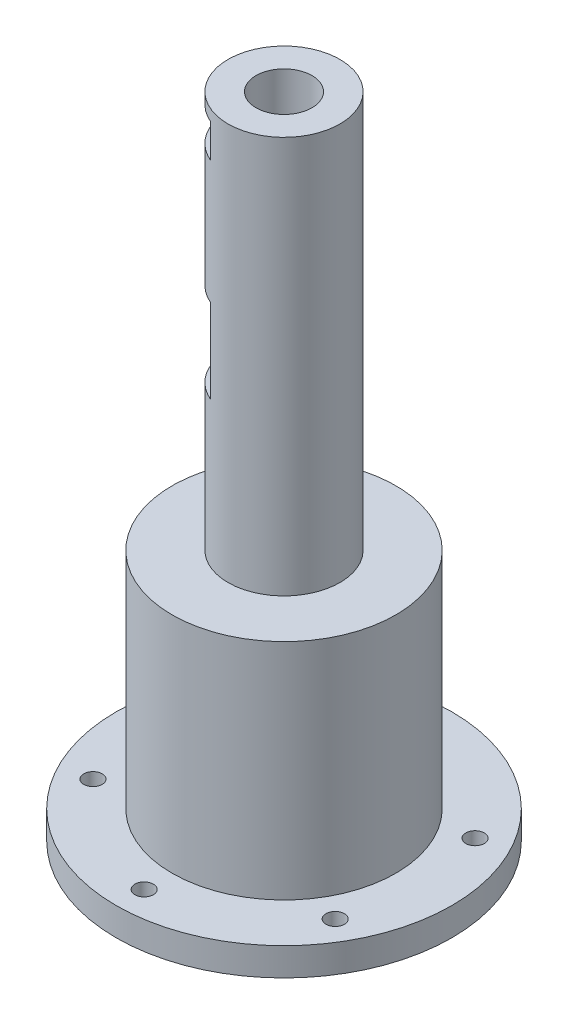
ISO-10303-21;
HEADER;
FILE_DESCRIPTION(('STEP AP214'),'2;1');
FILE_NAME('part.step','',(''),(''),'','','');
FILE_SCHEMA(('AUTOMOTIVE_DESIGN { 1 0 10303 214 1 1 1 1 }'));
ENDSEC;
DATA;
#1=APPLICATION_CONTEXT('core data for automotive mechanical design processes');
#2=APPLICATION_PROTOCOL_DEFINITION('international standard','automotive_design',2000,#1);
#3=PRODUCT_CONTEXT('',#1,'mechanical');
#4=PRODUCT('Part','Part','',(#3));
#5=PRODUCT_RELATED_PRODUCT_CATEGORY('part','',(#4));
#6=PRODUCT_DEFINITION_FORMATION('','',#4);
#7=PRODUCT_DEFINITION_CONTEXT('part definition',#1,'design');
#8=PRODUCT_DEFINITION('design','',#6,#7);
#9=PRODUCT_DEFINITION_SHAPE('','',#8);
#10=(LENGTH_UNIT() NAMED_UNIT(*) SI_UNIT(.MILLI.,.METRE.));
#11=(NAMED_UNIT(*) PLANE_ANGLE_UNIT() SI_UNIT($,.RADIAN.));
#12=(NAMED_UNIT(*) SI_UNIT($,.STERADIAN.) SOLID_ANGLE_UNIT());
#13=UNCERTAINTY_MEASURE_WITH_UNIT(LENGTH_MEASURE(1.E-05),#10,'distance_accuracy_value','');
#14=(GEOMETRIC_REPRESENTATION_CONTEXT(3) GLOBAL_UNCERTAINTY_ASSIGNED_CONTEXT((#13)) GLOBAL_UNIT_ASSIGNED_CONTEXT((#10,
#11,#12)) REPRESENTATION_CONTEXT('',''));
#15=CARTESIAN_POINT('',(0.,0.,0.));
#16=DIRECTION('',(0.,0.,1.));
#17=DIRECTION('',(1.,0.,0.));
#18=AXIS2_PLACEMENT_3D('',#15,#16,#17);
#19=CARTESIAN_POINT('',(0.,116.,0.));
#20=DIRECTION('',(0.,-1.,0.));
#21=DIRECTION('',(0.,0.,-1.));
#22=AXIS2_PLACEMENT_3D('',#19,#20,#21);
#23=CYLINDRICAL_SURFACE('',#22,10.);
#24=CARTESIAN_POINT('',(0.,108.,0.));
#25=DIRECTION('',(0.,-1.,0.));
#26=DIRECTION('',(0.,0.,-1.));
#27=AXIS2_PLACEMENT_3D('',#24,#25,#26);
#28=CIRCLE('',#27,10.);
#29=CARTESIAN_POINT('',(-6.,108.,-8.));
#30=VERTEX_POINT('',#29);
#31=CARTESIAN_POINT('',(6.,108.,-8.));
#32=VERTEX_POINT('',#31);
#33=EDGE_CURVE('E101',#30,#32,#28,.T.);
#34=ORIENTED_EDGE('',*,*,#33,.T.);
#35=DIRECTION('',(0.,-1.,0.));
#36=VECTOR('',#35,1.);
#37=CARTESIAN_POINT('',(6.,116.,-8.));
#38=LINE('',#37,#36);
#39=CARTESIAN_POINT('',(6.,114.,-8.));
#40=VERTEX_POINT('',#39);
#41=EDGE_CURVE('E11',#40,#32,#38,.T.);
#42=ORIENTED_EDGE('',*,*,#41,.F.);
#43=CARTESIAN_POINT('',(0.,114.,0.));
#44=DIRECTION('',(0.,1.,0.));
#45=DIRECTION('',(0.,0.,1.));
#46=AXIS2_PLACEMENT_3D('',#43,#44,#45);
#47=CIRCLE('',#46,10.);
#48=CARTESIAN_POINT('',(-6.,114.,-8.));
#49=VERTEX_POINT('',#48);
#50=EDGE_CURVE('E105',#40,#49,#47,.T.);
#51=ORIENTED_EDGE('',*,*,#50,.T.);
#52=DIRECTION('',(0.,-1.,0.));
#53=VECTOR('',#52,1.);
#54=CARTESIAN_POINT('',(-6.,116.,-8.));
#55=LINE('',#54,#53);
#56=EDGE_CURVE('E43',#30,#49,#55,.F.);
#57=ORIENTED_EDGE('',*,*,#56,.F.);
#58=EDGE_LOOP('',(#34,#42,#51,#57));
#59=FACE_BOUND('',#58,.T.);
#60=DIRECTION('',(0.,-1.,0.));
#61=VECTOR('',#60,1.);
#62=CARTESIAN_POINT('',(6.,116.,-8.));
#63=LINE('',#62,#61);
#64=CARTESIAN_POINT('',(6.,86.,-8.));
#65=VERTEX_POINT('',#64);
#66=CARTESIAN_POINT('',(6.,71.,-8.));
#67=VERTEX_POINT('',#66);
#68=EDGE_CURVE('E198',#65,#67,#63,.T.);
#69=ORIENTED_EDGE('',*,*,#68,.F.);
#70=CARTESIAN_POINT('',(0.,86.,0.));
#71=DIRECTION('',(0.,1.,0.));
#72=DIRECTION('',(0.,0.,1.));
#73=AXIS2_PLACEMENT_3D('',#70,#71,#72);
#74=CIRCLE('',#73,10.);
#75=CARTESIAN_POINT('',(-6.,86.,-8.));
#76=VERTEX_POINT('',#75);
#77=EDGE_CURVE('E193',#65,#76,#74,.T.);
#78=ORIENTED_EDGE('',*,*,#77,.T.);
#79=DIRECTION('',(0.,-1.,0.));
#80=VECTOR('',#79,1.);
#81=CARTESIAN_POINT('',(-6.,116.,-8.));
#82=LINE('',#81,#80);
#83=CARTESIAN_POINT('',(-6.,71.,-8.));
#84=VERTEX_POINT('',#83);
#85=EDGE_CURVE('E196',#84,#76,#82,.F.);
#86=ORIENTED_EDGE('',*,*,#85,.F.);
#87=CARTESIAN_POINT('',(0.,71.,0.));
#88=DIRECTION('',(0.,-1.,0.));
#89=DIRECTION('',(0.,0.,-1.));
#90=AXIS2_PLACEMENT_3D('',#87,#88,#89);
#91=CIRCLE('',#90,10.);
#92=EDGE_CURVE('E180',#84,#67,#91,.T.);
#93=ORIENTED_EDGE('',*,*,#92,.T.);
#94=EDGE_LOOP('',(#69,#78,#86,#93));
#95=FACE_BOUND('',#94,.T.);
#96=CARTESIAN_POINT('',(0.,116.,0.));
#97=DIRECTION('',(0.,1.,0.));
#98=DIRECTION('',(0.,0.,1.));
#99=AXIS2_PLACEMENT_3D('',#96,#97,#98);
#100=CIRCLE('',#99,10.);
#101=CARTESIAN_POINT('',(0.,116.,10.));
#102=VERTEX_POINT('',#101);
#103=EDGE_CURVE('E173',#102,#102,#100,.T.);
#104=ORIENTED_EDGE('',*,*,#103,.F.);
#105=EDGE_LOOP('',(#104));
#106=FACE_BOUND('',#105,.T.);
#107=CARTESIAN_POINT('',(0.,45.,0.));
#108=DIRECTION('',(0.,1.,0.));
#109=DIRECTION('',(0.,0.,1.));
#110=AXIS2_PLACEMENT_3D('',#107,#108,#109);
#111=CIRCLE('',#110,10.);
#112=CARTESIAN_POINT('',(0.,45.,10.));
#113=VERTEX_POINT('',#112);
#114=EDGE_CURVE('E177',#113,#113,#111,.T.);
#115=ORIENTED_EDGE('',*,*,#114,.T.);
#116=EDGE_LOOP('',(#115));
#117=FACE_BOUND('',#116,.T.);
#118=DIRECTION('',(0.,-1.,0.));
#119=VECTOR('',#118,1.);
#120=CARTESIAN_POINT('',(-9.92820323027551,116.,-1.19615242270666));
#121=LINE('',#120,#119);
#122=CARTESIAN_POINT('',(-9.92820323027551,86.,-1.19615242270666));
#123=VERTEX_POINT('',#122);
#124=CARTESIAN_POINT('',(-9.92820323027551,71.,-1.19615242270666));
#125=VERTEX_POINT('',#124);
#126=EDGE_CURVE('E209',#123,#125,#121,.T.);
#127=ORIENTED_EDGE('',*,*,#126,.F.);
#128=CARTESIAN_POINT('',(0.,86.,0.));
#129=DIRECTION('',(0.,1.,0.));
#130=DIRECTION('',(0.,0.,1.));
#131=AXIS2_PLACEMENT_3D('',#128,#129,#130);
#132=CIRCLE('',#131,10.);
#133=CARTESIAN_POINT('',(-3.92820323027553,86.,9.19615242270662));
#134=VERTEX_POINT('',#133);
#135=EDGE_CURVE('E204',#123,#134,#132,.T.);
#136=ORIENTED_EDGE('',*,*,#135,.T.);
#137=DIRECTION('',(0.,-1.,0.));
#138=VECTOR('',#137,1.);
#139=CARTESIAN_POINT('',(-3.92820323027553,116.,9.19615242270662));
#140=LINE('',#139,#138);
#141=CARTESIAN_POINT('',(-3.92820323027553,71.,9.19615242270662));
#142=VERTEX_POINT('',#141);
#143=EDGE_CURVE('E207',#142,#134,#140,.F.);
#144=ORIENTED_EDGE('',*,*,#143,.F.);
#145=CARTESIAN_POINT('',(0.,71.,0.));
#146=DIRECTION('',(0.,-1.,0.));
#147=DIRECTION('',(0.,0.,-1.));
#148=AXIS2_PLACEMENT_3D('',#145,#146,#147);
#149=CIRCLE('',#148,10.);
#150=EDGE_CURVE('E201',#142,#125,#149,.T.);
#151=ORIENTED_EDGE('',*,*,#150,.T.);
#152=EDGE_LOOP('',(#127,#136,#144,#151));
#153=FACE_BOUND('',#152,.T.);
#154=DIRECTION('',(0.,-1.,0.));
#155=VECTOR('',#154,1.);
#156=CARTESIAN_POINT('',(-3.92820323027553,116.,9.19615242270662));
#157=LINE('',#156,#155);
#158=CARTESIAN_POINT('',(-3.92820323027553,108.,9.19615242270662));
#159=VERTEX_POINT('',#158);
#160=CARTESIAN_POINT('',(-3.92820323027553,114.,9.19615242270662));
#161=VERTEX_POINT('',#160);
#162=EDGE_CURVE('E215',#159,#161,#157,.F.);
#163=ORIENTED_EDGE('',*,*,#162,.F.);
#164=CARTESIAN_POINT('',(0.,108.,0.));
#165=DIRECTION('',(0.,-1.,0.));
#166=DIRECTION('',(0.,0.,-1.));
#167=AXIS2_PLACEMENT_3D('',#164,#165,#166);
#168=CIRCLE('',#167,10.);
#169=CARTESIAN_POINT('',(-9.92820323027551,108.,-1.19615242270666));
#170=VERTEX_POINT('',#169);
#171=EDGE_CURVE('E56',#159,#170,#168,.T.);
#172=ORIENTED_EDGE('',*,*,#171,.T.);
#173=DIRECTION('',(0.,-1.,0.));
#174=VECTOR('',#173,1.);
#175=CARTESIAN_POINT('',(-9.92820323027551,116.,-1.19615242270666));
#176=LINE('',#175,#174);
#177=CARTESIAN_POINT('',(-9.92820323027551,114.,-1.19615242270666));
#178=VERTEX_POINT('',#177);
#179=EDGE_CURVE('E217',#178,#170,#176,.T.);
#180=ORIENTED_EDGE('',*,*,#179,.F.);
#181=CARTESIAN_POINT('',(0.,114.,0.));
#182=DIRECTION('',(0.,1.,0.));
#183=DIRECTION('',(0.,0.,1.));
#184=AXIS2_PLACEMENT_3D('',#181,#182,#183);
#185=CIRCLE('',#184,10.);
#186=EDGE_CURVE('E211',#178,#161,#185,.T.);
#187=ORIENTED_EDGE('',*,*,#186,.T.);
#188=EDGE_LOOP('',(#163,#172,#180,#187));
#189=FACE_BOUND('',#188,.T.);
#190=ADVANCED_FACE('F35',(#59,#95,#106,#117,#153,#189),#23,.T.);
#191=CARTESIAN_POINT('',(0.,5.,0.));
#192=DIRECTION('',(0.,-1.,0.));
#193=DIRECTION('',(0.,0.,-1.));
#194=AXIS2_PLACEMENT_3D('',#191,#192,#193);
#195=CYLINDRICAL_SURFACE('',#194,30.);
#196=CARTESIAN_POINT('',(0.,5.,0.));
#197=DIRECTION('',(0.,1.,0.));
#198=DIRECTION('',(0.,0.,1.));
#199=AXIS2_PLACEMENT_3D('',#196,#197,#198);
#200=CIRCLE('',#199,30.);
#201=CARTESIAN_POINT('',(0.,5.,30.));
#202=VERTEX_POINT('',#201);
#203=EDGE_CURVE('E187',#202,#202,#200,.T.);
#204=ORIENTED_EDGE('',*,*,#203,.F.);
#205=EDGE_LOOP('',(#204));
#206=FACE_BOUND('',#205,.T.);
#207=CARTESIAN_POINT('',(0.,0.,0.));
#208=DIRECTION('',(0.,1.,0.));
#209=DIRECTION('',(0.,0.,1.));
#210=AXIS2_PLACEMENT_3D('',#207,#208,#209);
#211=CIRCLE('',#210,30.);
#212=CARTESIAN_POINT('',(0.,0.,30.));
#213=VERTEX_POINT('',#212);
#214=EDGE_CURVE('E184',#213,#213,#211,.T.);
#215=ORIENTED_EDGE('',*,*,#214,.T.);
#216=EDGE_LOOP('',(#215));
#217=FACE_BOUND('',#216,.T.);
#218=ADVANCED_FACE('F37',(#206,#217),#195,.T.);
#219=CARTESIAN_POINT('',(0.,5.,0.));
#220=DIRECTION('',(0.,1.,0.));
#221=DIRECTION('',(0.,0.,1.));
#222=AXIS2_PLACEMENT_3D('',#219,#220,#221);
#223=PLANE('',#222);
#224=CARTESIAN_POINT('',(0.,5.,-25.));
#225=DIRECTION('',(0.,1.,0.));
#226=DIRECTION('',(0.,0.,1.));
#227=AXIS2_PLACEMENT_3D('',#224,#225,#226);
#228=CIRCLE('',#227,1.64999999999999);
#229=CARTESIAN_POINT('',(0.,5.,-23.35));
#230=VERTEX_POINT('',#229);
#231=EDGE_CURVE('E120',#230,#230,#228,.T.);
#232=ORIENTED_EDGE('',*,*,#231,.F.);
#233=EDGE_LOOP('',(#232));
#234=FACE_BOUND('',#233,.T.);
#235=CARTESIAN_POINT('',(21.6506350946117,5.,-12.5000000000014));
#236=DIRECTION('',(0.,1.,0.));
#237=DIRECTION('',(0.,0.,1.));
#238=AXIS2_PLACEMENT_3D('',#235,#236,#237);
#239=CIRCLE('',#238,1.64999999999999);
#240=CARTESIAN_POINT('',(21.6506350946117,5.,-10.8500000000014));
#241=VERTEX_POINT('',#240);
#242=EDGE_CURVE('E126',#241,#241,#239,.T.);
#243=ORIENTED_EDGE('',*,*,#242,.F.);
#244=EDGE_LOOP('',(#243));
#245=FACE_BOUND('',#244,.T.);
#246=CARTESIAN_POINT('',(21.6506350946133,5.,12.4999999999986));
#247=DIRECTION('',(0.,1.,0.));
#248=DIRECTION('',(0.,0.,1.));
#249=AXIS2_PLACEMENT_3D('',#246,#247,#248);
#250=CIRCLE('',#249,1.64999999999999);
#251=CARTESIAN_POINT('',(21.6506350946133,5.,14.1499999999986));
#252=VERTEX_POINT('',#251);
#253=EDGE_CURVE('E132',#252,#252,#250,.T.);
#254=ORIENTED_EDGE('',*,*,#253,.F.);
#255=EDGE_LOOP('',(#254));
#256=FACE_BOUND('',#255,.T.);
#257=CARTESIAN_POINT('',(-21.6506350946102,5.,-12.4999999999986));
#258=DIRECTION('',(0.,1.,0.));
#259=DIRECTION('',(0.,0.,1.));
#260=AXIS2_PLACEMENT_3D('',#257,#258,#259);
#261=CIRCLE('',#260,1.64999999999999);
#262=CARTESIAN_POINT('',(-21.6506350946102,5.,-10.8499999999986));
#263=VERTEX_POINT('',#262);
#264=EDGE_CURVE('E138',#263,#263,#261,.T.);
#265=ORIENTED_EDGE('',*,*,#264,.F.);
#266=EDGE_LOOP('',(#265));
#267=FACE_BOUND('',#266,.T.);
#268=CARTESIAN_POINT('',(-21.6506350946086,5.,12.5000000000014));
#269=DIRECTION('',(0.,1.,0.));
#270=DIRECTION('',(0.,0.,1.));
#271=AXIS2_PLACEMENT_3D('',#268,#269,#270);
#272=CIRCLE('',#271,1.64999999999999);
#273=CARTESIAN_POINT('',(-21.6506350946086,5.,14.1500000000013));
#274=VERTEX_POINT('',#273);
#275=EDGE_CURVE('E144',#274,#274,#272,.T.);
#276=ORIENTED_EDGE('',*,*,#275,.F.);
#277=EDGE_LOOP('',(#276));
#278=FACE_BOUND('',#277,.T.);
#279=CARTESIAN_POINT('',(3.11934631824934E-12,5.,25.));
#280=DIRECTION('',(0.,1.,0.));
#281=DIRECTION('',(0.,0.,1.));
#282=AXIS2_PLACEMENT_3D('',#279,#280,#281);
#283=CIRCLE('',#282,1.64999999999999);
#284=CARTESIAN_POINT('',(3.11934631824934E-12,5.,26.65));
#285=VERTEX_POINT('',#284);
#286=EDGE_CURVE('E150',#285,#285,#283,.T.);
#287=ORIENTED_EDGE('',*,*,#286,.F.);
#288=EDGE_LOOP('',(#287));
#289=FACE_BOUND('',#288,.T.);
#290=CARTESIAN_POINT('',(0.,5.,0.));
#291=DIRECTION('',(0.,1.,0.));
#292=DIRECTION('',(0.,0.,1.));
#293=AXIS2_PLACEMENT_3D('',#290,#291,#292);
#294=CIRCLE('',#293,20.);
#295=CARTESIAN_POINT('',(0.,5.,20.));
#296=VERTEX_POINT('',#295);
#297=EDGE_CURVE('E181',#296,#296,#294,.T.);
#298=ORIENTED_EDGE('',*,*,#297,.F.);
#299=EDGE_LOOP('',(#298));
#300=FACE_BOUND('',#299,.T.);
#301=ORIENTED_EDGE('',*,*,#203,.T.);
#302=EDGE_LOOP('',(#301));
#303=FACE_BOUND('',#302,.T.);
#304=ADVANCED_FACE('F236',(#234,#245,#256,#267,#278,#289,#300,#303),#223,.T.);
#305=CARTESIAN_POINT('',(0.,0.,0.));
#306=DIRECTION('',(0.,1.,0.));
#307=DIRECTION('',(0.,0.,1.));
#308=AXIS2_PLACEMENT_3D('',#305,#306,#307);
#309=PLANE('',#308);
#310=CARTESIAN_POINT('',(0.,0.,-25.));
#311=DIRECTION('',(0.,1.,0.));
#312=DIRECTION('',(0.,0.,1.));
#313=AXIS2_PLACEMENT_3D('',#310,#311,#312);
#314=CIRCLE('',#313,1.64999999999999);
#315=CARTESIAN_POINT('',(0.,0.,-23.35));
#316=VERTEX_POINT('',#315);
#317=EDGE_CURVE('E123',#316,#316,#314,.T.);
#318=ORIENTED_EDGE('',*,*,#317,.T.);
#319=EDGE_LOOP('',(#318));
#320=FACE_BOUND('',#319,.T.);
#321=CARTESIAN_POINT('',(21.6506350946117,0.,-12.5000000000014));
#322=DIRECTION('',(0.,1.,0.));
#323=DIRECTION('',(0.,0.,1.));
#324=AXIS2_PLACEMENT_3D('',#321,#322,#323);
#325=CIRCLE('',#324,1.64999999999999);
#326=CARTESIAN_POINT('',(21.6506350946117,0.,-10.8500000000014));
#327=VERTEX_POINT('',#326);
#328=EDGE_CURVE('E129',#327,#327,#325,.T.);
#329=ORIENTED_EDGE('',*,*,#328,.T.);
#330=EDGE_LOOP('',(#329));
#331=FACE_BOUND('',#330,.T.);
#332=CARTESIAN_POINT('',(21.6506350946133,0.,12.4999999999986));
#333=DIRECTION('',(0.,1.,0.));
#334=DIRECTION('',(0.,0.,1.));
#335=AXIS2_PLACEMENT_3D('',#332,#333,#334);
#336=CIRCLE('',#335,1.64999999999999);
#337=CARTESIAN_POINT('',(21.6506350946133,0.,14.1499999999986));
#338=VERTEX_POINT('',#337);
#339=EDGE_CURVE('E135',#338,#338,#336,.T.);
#340=ORIENTED_EDGE('',*,*,#339,.T.);
#341=EDGE_LOOP('',(#340));
#342=FACE_BOUND('',#341,.T.);
#343=CARTESIAN_POINT('',(-21.6506350946102,0.,-12.4999999999986));
#344=DIRECTION('',(0.,1.,0.));
#345=DIRECTION('',(0.,0.,1.));
#346=AXIS2_PLACEMENT_3D('',#343,#344,#345);
#347=CIRCLE('',#346,1.64999999999999);
#348=CARTESIAN_POINT('',(-21.6506350946102,0.,-10.8499999999986));
#349=VERTEX_POINT('',#348);
#350=EDGE_CURVE('E141',#349,#349,#347,.T.);
#351=ORIENTED_EDGE('',*,*,#350,.T.);
#352=EDGE_LOOP('',(#351));
#353=FACE_BOUND('',#352,.T.);
#354=CARTESIAN_POINT('',(-21.6506350946086,0.,12.5000000000014));
#355=DIRECTION('',(0.,1.,0.));
#356=DIRECTION('',(0.,0.,1.));
#357=AXIS2_PLACEMENT_3D('',#354,#355,#356);
#358=CIRCLE('',#357,1.64999999999999);
#359=CARTESIAN_POINT('',(-21.6506350946086,0.,14.1500000000014));
#360=VERTEX_POINT('',#359);
#361=EDGE_CURVE('E147',#360,#360,#358,.T.);
#362=ORIENTED_EDGE('',*,*,#361,.T.);
#363=EDGE_LOOP('',(#362));
#364=FACE_BOUND('',#363,.T.);
#365=CARTESIAN_POINT('',(3.11934631824934E-12,0.,25.));
#366=DIRECTION('',(0.,1.,0.));
#367=DIRECTION('',(0.,0.,1.));
#368=AXIS2_PLACEMENT_3D('',#365,#366,#367);
#369=CIRCLE('',#368,1.64999999999999);
#370=CARTESIAN_POINT('',(3.11934631824934E-12,0.,26.65));
#371=VERTEX_POINT('',#370);
#372=EDGE_CURVE('E153',#371,#371,#369,.T.);
#373=ORIENTED_EDGE('',*,*,#372,.T.);
#374=EDGE_LOOP('',(#373));
#375=FACE_BOUND('',#374,.T.);
#376=CARTESIAN_POINT('',(0.,0.,0.));
#377=DIRECTION('',(0.,1.,0.));
#378=DIRECTION('',(0.,0.,1.));
#379=AXIS2_PLACEMENT_3D('',#376,#377,#378);
#380=CIRCLE('',#379,5.);
#381=CARTESIAN_POINT('',(0.,0.,5.));
#382=VERTEX_POINT('',#381);
#383=EDGE_CURVE('E170',#382,#382,#380,.F.);
#384=ORIENTED_EDGE('',*,*,#383,.F.);
#385=EDGE_LOOP('',(#384));
#386=FACE_BOUND('',#385,.T.);
#387=ORIENTED_EDGE('',*,*,#214,.F.);
#388=EDGE_LOOP('',(#387));
#389=FACE_BOUND('',#388,.T.);
#390=ADVANCED_FACE('F249',(#320,#331,#342,#353,#364,#375,#386,#389),#309,.F.);
#391=CARTESIAN_POINT('',(0.,45.,0.));
#392=DIRECTION('',(0.,-1.,0.));
#393=DIRECTION('',(0.,0.,-1.));
#394=AXIS2_PLACEMENT_3D('',#391,#392,#393);
#395=CYLINDRICAL_SURFACE('',#394,20.);
#396=CARTESIAN_POINT('',(0.,45.,0.));
#397=DIRECTION('',(0.,1.,0.));
#398=DIRECTION('',(0.,0.,1.));
#399=AXIS2_PLACEMENT_3D('',#396,#397,#398);
#400=CIRCLE('',#399,20.);
#401=CARTESIAN_POINT('',(0.,45.,20.));
#402=VERTEX_POINT('',#401);
#403=EDGE_CURVE('E176',#402,#402,#400,.T.);
#404=ORIENTED_EDGE('',*,*,#403,.F.);
#405=EDGE_LOOP('',(#404));
#406=FACE_BOUND('',#405,.T.);
#407=ORIENTED_EDGE('',*,*,#297,.T.);
#408=EDGE_LOOP('',(#407));
#409=FACE_BOUND('',#408,.T.);
#410=ADVANCED_FACE('F245',(#406,#409),#395,.T.);
#411=CARTESIAN_POINT('',(0.,45.,0.));
#412=DIRECTION('',(0.,1.,0.));
#413=DIRECTION('',(0.,0.,1.));
#414=AXIS2_PLACEMENT_3D('',#411,#412,#413);
#415=PLANE('',#414);
#416=ORIENTED_EDGE('',*,*,#114,.F.);
#417=EDGE_LOOP('',(#416));
#418=FACE_BOUND('',#417,.T.);
#419=ORIENTED_EDGE('',*,*,#403,.T.);
#420=EDGE_LOOP('',(#419));
#421=FACE_BOUND('',#420,.T.);
#422=ADVANCED_FACE('F242',(#418,#421),#415,.T.);
#423=CARTESIAN_POINT('',(0.,116.,0.));
#424=DIRECTION('',(0.,1.,0.));
#425=DIRECTION('',(0.,0.,1.));
#426=AXIS2_PLACEMENT_3D('',#423,#424,#425);
#427=PLANE('',#426);
#428=CARTESIAN_POINT('',(0.,116.,0.));
#429=DIRECTION('',(0.,1.,0.));
#430=DIRECTION('',(0.,0.,1.));
#431=AXIS2_PLACEMENT_3D('',#428,#429,#430);
#432=CIRCLE('',#431,5.);
#433=CARTESIAN_POINT('',(0.,116.,5.));
#434=VERTEX_POINT('',#433);
#435=EDGE_CURVE('E167',#434,#434,#432,.T.);
#436=ORIENTED_EDGE('',*,*,#435,.F.);
#437=EDGE_LOOP('',(#436));
#438=FACE_BOUND('',#437,.T.);
#439=ORIENTED_EDGE('',*,*,#103,.T.);
#440=EDGE_LOOP('',(#439));
#441=FACE_BOUND('',#440,.T.);
#442=ADVANCED_FACE('F240',(#438,#441),#427,.T.);
#443=CARTESIAN_POINT('',(0.,-0.001000000000001,0.));
#444=DIRECTION('',(0.,1.,0.));
#445=DIRECTION('',(0.,0.,1.));
#446=AXIS2_PLACEMENT_3D('',#443,#444,#445);
#447=CYLINDRICAL_SURFACE('',#446,5.);
#448=ORIENTED_EDGE('',*,*,#435,.T.);
#449=EDGE_LOOP('',(#448));
#450=FACE_BOUND('',#449,.T.);
#451=ORIENTED_EDGE('',*,*,#383,.T.);
#452=EDGE_LOOP('',(#451));
#453=FACE_BOUND('',#452,.T.);
#454=ADVANCED_FACE('F274',(#450,#453),#447,.F.);
#455=CARTESIAN_POINT('',(7.5,86.,-8.));
#456=DIRECTION('',(0.,1.,0.));
#457=DIRECTION('',(0.,0.,1.));
#458=AXIS2_PLACEMENT_3D('',#455,#456,#457);
#459=PLANE('',#458);
#460=DIRECTION('',(1.,0.,0.));
#461=VECTOR('',#460,1.);
#462=CARTESIAN_POINT('',(7.5,86.,-8.));
#463=LINE('',#462,#461);
#464=EDGE_CURVE('E164',#76,#65,#463,.T.);
#465=ORIENTED_EDGE('',*,*,#464,.F.);
#466=ORIENTED_EDGE('',*,*,#77,.F.);
#467=EDGE_LOOP('',(#465,#466));
#468=FACE_BOUND('',#467,.T.);
#469=ADVANCED_FACE('F276',(#468),#459,.F.);
#470=CARTESIAN_POINT('',(7.5,71.,-8.));
#471=DIRECTION('',(0.,-1.,0.));
#472=DIRECTION('',(0.,0.,-1.));
#473=AXIS2_PLACEMENT_3D('',#470,#471,#472);
#474=PLANE('',#473);
#475=ORIENTED_EDGE('',*,*,#92,.F.);
#476=DIRECTION('',(-1.,0.,0.));
#477=VECTOR('',#476,1.);
#478=CARTESIAN_POINT('',(7.5,71.,-8.));
#479=LINE('',#478,#477);
#480=EDGE_CURVE('E162',#67,#84,#479,.T.);
#481=ORIENTED_EDGE('',*,*,#480,.F.);
#482=EDGE_LOOP('',(#475,#481));
#483=FACE_BOUND('',#482,.T.);
#484=ADVANCED_FACE('F282',(#483),#474,.F.);
#485=CARTESIAN_POINT('',(0.,0.,-8.));
#486=DIRECTION('',(0.,0.,-1.));
#487=DIRECTION('',(-1.,0.,0.));
#488=AXIS2_PLACEMENT_3D('',#485,#486,#487);
#489=PLANE('',#488);
#490=ORIENTED_EDGE('',*,*,#68,.T.);
#491=ORIENTED_EDGE('',*,*,#480,.T.);
#492=ORIENTED_EDGE('',*,*,#85,.T.);
#493=ORIENTED_EDGE('',*,*,#464,.T.);
#494=EDGE_LOOP('',(#490,#491,#492,#493));
#495=FACE_BOUND('',#494,.T.);
#496=ADVANCED_FACE('F288',(#495),#489,.T.);
#497=CARTESIAN_POINT('',(-3.17820323027554,86.,10.4951905283833));
#498=DIRECTION('',(0.,1.,0.));
#499=DIRECTION('',(0.,0.,1.));
#500=AXIS2_PLACEMENT_3D('',#497,#498,#499);
#501=PLANE('',#500);
#502=DIRECTION('',(-0.499999999999998,0.,-0.86602540378444));
#503=VECTOR('',#502,1.);
#504=CARTESIAN_POINT('',(-3.17820323027554,86.,10.4951905283833));
#505=LINE('',#504,#503);
#506=EDGE_CURVE('E156',#134,#123,#505,.T.);
#507=ORIENTED_EDGE('',*,*,#506,.F.);
#508=ORIENTED_EDGE('',*,*,#135,.F.);
#509=EDGE_LOOP('',(#507,#508));
#510=FACE_BOUND('',#509,.T.);
#511=ADVANCED_FACE('F293',(#510),#501,.F.);
#512=CARTESIAN_POINT('',(-3.17820323027554,71.,10.4951905283833));
#513=DIRECTION('',(0.,-1.,0.));
#514=DIRECTION('',(0.,0.,-1.));
#515=AXIS2_PLACEMENT_3D('',#512,#513,#514);
#516=PLANE('',#515);
#517=DIRECTION('',(0.499999999999998,0.,0.86602540378444));
#518=VECTOR('',#517,1.);
#519=CARTESIAN_POINT('',(-3.17820323027554,71.,10.4951905283833));
#520=LINE('',#519,#518);
#521=EDGE_CURVE('E159',#125,#142,#520,.T.);
#522=ORIENTED_EDGE('',*,*,#521,.F.);
#523=ORIENTED_EDGE('',*,*,#150,.F.);
#524=EDGE_LOOP('',(#522,#523));
#525=FACE_BOUND('',#524,.T.);
#526=ADVANCED_FACE('F297',(#525),#516,.F.);
#527=CARTESIAN_POINT('',(-6.92820323027552,0.,3.99999999999998));
#528=DIRECTION('',(-0.86602540378444,0.,0.499999999999998));
#529=DIRECTION('',(0.499999999999998,0.,0.86602540378444));
#530=AXIS2_PLACEMENT_3D('',#527,#528,#529);
#531=PLANE('',#530);
#532=ORIENTED_EDGE('',*,*,#126,.T.);
#533=ORIENTED_EDGE('',*,*,#521,.T.);
#534=ORIENTED_EDGE('',*,*,#143,.T.);
#535=ORIENTED_EDGE('',*,*,#506,.T.);
#536=EDGE_LOOP('',(#532,#533,#534,#535));
#537=FACE_BOUND('',#536,.T.);
#538=ADVANCED_FACE('F301',(#537),#531,.T.);
#539=CARTESIAN_POINT('',(3.11934631824934E-12,5.,25.));
#540=DIRECTION('',(0.,1.,0.));
#541=DIRECTION('',(0.,0.,1.));
#542=AXIS2_PLACEMENT_3D('',#539,#540,#541);
#543=CYLINDRICAL_SURFACE('',#542,1.64999999999999);
#544=ORIENTED_EDGE('',*,*,#372,.F.);
#545=EDGE_LOOP('',(#544));
#546=FACE_BOUND('',#545,.T.);
#547=ORIENTED_EDGE('',*,*,#286,.T.);
#548=EDGE_LOOP('',(#547));
#549=FACE_BOUND('',#548,.T.);
#550=ADVANCED_FACE('F305',(#546,#549),#543,.F.);
#551=CARTESIAN_POINT('',(-21.6506350946086,5.,12.5000000000014));
#552=DIRECTION('',(0.,1.,0.));
#553=DIRECTION('',(0.,0.,1.));
#554=AXIS2_PLACEMENT_3D('',#551,#552,#553);
#555=CYLINDRICAL_SURFACE('',#554,1.64999999999999);
#556=ORIENTED_EDGE('',*,*,#361,.F.);
#557=EDGE_LOOP('',(#556));
#558=FACE_BOUND('',#557,.T.);
#559=ORIENTED_EDGE('',*,*,#275,.T.);
#560=EDGE_LOOP('',(#559));
#561=FACE_BOUND('',#560,.T.);
#562=ADVANCED_FACE('F309',(#558,#561),#555,.F.);
#563=CARTESIAN_POINT('',(-21.6506350946102,5.,-12.4999999999986));
#564=DIRECTION('',(0.,1.,0.));
#565=DIRECTION('',(0.,0.,1.));
#566=AXIS2_PLACEMENT_3D('',#563,#564,#565);
#567=CYLINDRICAL_SURFACE('',#566,1.64999999999999);
#568=ORIENTED_EDGE('',*,*,#350,.F.);
#569=EDGE_LOOP('',(#568));
#570=FACE_BOUND('',#569,.T.);
#571=ORIENTED_EDGE('',*,*,#264,.T.);
#572=EDGE_LOOP('',(#571));
#573=FACE_BOUND('',#572,.T.);
#574=ADVANCED_FACE('F313',(#570,#573),#567,.F.);
#575=CARTESIAN_POINT('',(21.6506350946133,5.,12.4999999999986));
#576=DIRECTION('',(0.,1.,0.));
#577=DIRECTION('',(0.,0.,1.));
#578=AXIS2_PLACEMENT_3D('',#575,#576,#577);
#579=CYLINDRICAL_SURFACE('',#578,1.64999999999999);
#580=ORIENTED_EDGE('',*,*,#339,.F.);
#581=EDGE_LOOP('',(#580));
#582=FACE_BOUND('',#581,.T.);
#583=ORIENTED_EDGE('',*,*,#253,.T.);
#584=EDGE_LOOP('',(#583));
#585=FACE_BOUND('',#584,.T.);
#586=ADVANCED_FACE('F317',(#582,#585),#579,.F.);
#587=CARTESIAN_POINT('',(21.6506350946117,5.,-12.5000000000014));
#588=DIRECTION('',(0.,1.,0.));
#589=DIRECTION('',(0.,0.,1.));
#590=AXIS2_PLACEMENT_3D('',#587,#588,#589);
#591=CYLINDRICAL_SURFACE('',#590,1.64999999999999);
#592=ORIENTED_EDGE('',*,*,#328,.F.);
#593=EDGE_LOOP('',(#592));
#594=FACE_BOUND('',#593,.T.);
#595=ORIENTED_EDGE('',*,*,#242,.T.);
#596=EDGE_LOOP('',(#595));
#597=FACE_BOUND('',#596,.T.);
#598=ADVANCED_FACE('F321',(#594,#597),#591,.F.);
#599=CARTESIAN_POINT('',(0.,5.,-25.));
#600=DIRECTION('',(0.,1.,0.));
#601=DIRECTION('',(0.,0.,1.));
#602=AXIS2_PLACEMENT_3D('',#599,#600,#601);
#603=CYLINDRICAL_SURFACE('',#602,1.64999999999999);
#604=ORIENTED_EDGE('',*,*,#317,.F.);
#605=EDGE_LOOP('',(#604));
#606=FACE_BOUND('',#605,.T.);
#607=ORIENTED_EDGE('',*,*,#231,.T.);
#608=EDGE_LOOP('',(#607));
#609=FACE_BOUND('',#608,.T.);
#610=ADVANCED_FACE('F325',(#606,#609),#603,.F.);
#611=CARTESIAN_POINT('',(-3.17820323027553,108.,10.4951905283833));
#612=DIRECTION('',(0.,-1.,0.));
#613=DIRECTION('',(0.,0.,-1.));
#614=AXIS2_PLACEMENT_3D('',#611,#612,#613);
#615=PLANE('',#614);
#616=DIRECTION('',(0.499999999999998,0.,0.86602540378444));
#617=VECTOR('',#616,1.);
#618=CARTESIAN_POINT('',(-3.17820323027553,108.,10.4951905283833));
#619=LINE('',#618,#617);
#620=EDGE_CURVE('E112',#170,#159,#619,.T.);
#621=ORIENTED_EDGE('',*,*,#620,.F.);
#622=ORIENTED_EDGE('',*,*,#171,.F.);
#623=EDGE_LOOP('',(#621,#622));
#624=FACE_BOUND('',#623,.T.);
#625=ADVANCED_FACE('F329',(#624),#615,.F.);
#626=CARTESIAN_POINT('',(-3.17820323027553,114.,10.4951905283833));
#627=DIRECTION('',(0.,1.,0.));
#628=DIRECTION('',(0.,0.,1.));
#629=AXIS2_PLACEMENT_3D('',#626,#627,#628);
#630=PLANE('',#629);
#631=DIRECTION('',(-0.499999999999998,0.,-0.86602540378444));
#632=VECTOR('',#631,1.);
#633=CARTESIAN_POINT('',(-3.17820323027553,114.,10.4951905283833));
#634=LINE('',#633,#632);
#635=EDGE_CURVE('E114',#161,#178,#634,.T.);
#636=ORIENTED_EDGE('',*,*,#635,.F.);
#637=ORIENTED_EDGE('',*,*,#186,.F.);
#638=EDGE_LOOP('',(#636,#637));
#639=FACE_BOUND('',#638,.T.);
#640=ADVANCED_FACE('F333',(#639),#630,.F.);
#641=CARTESIAN_POINT('',(-6.92820323027551,0.,3.99999999999998));
#642=DIRECTION('',(-0.86602540378444,0.,0.499999999999998));
#643=DIRECTION('',(0.499999999999998,0.,0.86602540378444));
#644=AXIS2_PLACEMENT_3D('',#641,#642,#643);
#645=PLANE('',#644);
#646=ORIENTED_EDGE('',*,*,#179,.T.);
#647=ORIENTED_EDGE('',*,*,#620,.T.);
#648=ORIENTED_EDGE('',*,*,#162,.T.);
#649=ORIENTED_EDGE('',*,*,#635,.T.);
#650=EDGE_LOOP('',(#646,#647,#648,#649));
#651=FACE_BOUND('',#650,.T.);
#652=ADVANCED_FACE('F228',(#651),#645,.T.);
#653=CARTESIAN_POINT('',(6.87658093137195,108.,-8.));
#654=DIRECTION('',(0.,-1.,0.));
#655=DIRECTION('',(0.,0.,-1.));
#656=AXIS2_PLACEMENT_3D('',#653,#654,#655);
#657=PLANE('',#656);
#658=ORIENTED_EDGE('',*,*,#33,.F.);
#659=DIRECTION('',(-1.,0.,0.));
#660=VECTOR('',#659,1.);
#661=CARTESIAN_POINT('',(6.87658093137195,108.,-8.));
#662=LINE('',#661,#660);
#663=EDGE_CURVE('E49',#32,#30,#662,.T.);
#664=ORIENTED_EDGE('',*,*,#663,.F.);
#665=EDGE_LOOP('',(#658,#664));
#666=FACE_BOUND('',#665,.T.);
#667=ADVANCED_FACE('F111',(#666),#657,.F.);
#668=CARTESIAN_POINT('',(6.87658093137195,114.,-8.));
#669=DIRECTION('',(0.,1.,0.));
#670=DIRECTION('',(0.,0.,1.));
#671=AXIS2_PLACEMENT_3D('',#668,#669,#670);
#672=PLANE('',#671);
#673=DIRECTION('',(1.,0.,0.));
#674=VECTOR('',#673,1.);
#675=CARTESIAN_POINT('',(6.87658093137195,114.,-8.));
#676=LINE('',#675,#674);
#677=EDGE_CURVE('E110',#49,#40,#676,.T.);
#678=ORIENTED_EDGE('',*,*,#677,.F.);
#679=ORIENTED_EDGE('',*,*,#50,.F.);
#680=EDGE_LOOP('',(#678,#679));
#681=FACE_BOUND('',#680,.T.);
#682=ADVANCED_FACE('F220',(#681),#672,.F.);
#683=CARTESIAN_POINT('',(0.,0.,-8.));
#684=DIRECTION('',(0.,0.,-1.));
#685=DIRECTION('',(-1.,0.,0.));
#686=AXIS2_PLACEMENT_3D('',#683,#684,#685);
#687=PLANE('',#686);
#688=ORIENTED_EDGE('',*,*,#41,.T.);
#689=ORIENTED_EDGE('',*,*,#663,.T.);
#690=ORIENTED_EDGE('',*,*,#56,.T.);
#691=ORIENTED_EDGE('',*,*,#677,.T.);
#692=EDGE_LOOP('',(#688,#689,#690,#691));
#693=FACE_BOUND('',#692,.T.);
#694=ADVANCED_FACE('F108',(#693),#687,.T.);
#695=CLOSED_SHELL('',(#190,#218,#304,#390,#410,#422,#442,#454,#469,#484,#496,#511,#526,#538,
#550,#562,#574,#586,#598,#610,#625,#640,#652,#667,#682,#694));
#696=MANIFOLD_SOLID_BREP('B2',#695);
#697=ADVANCED_BREP_SHAPE_REPRESENTATION('',(#18,#696),#14);
#698=SHAPE_DEFINITION_REPRESENTATION(#9,#697);
ENDSEC;
END-ISO-10303-21;
